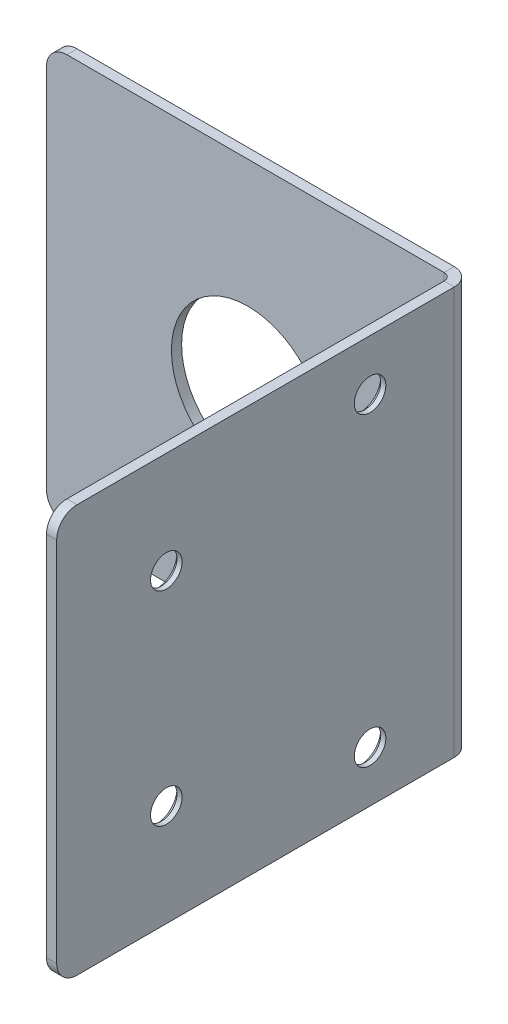
ISO-10303-21;
HEADER;
FILE_DESCRIPTION(('STEP AP214'),'2;1');
FILE_NAME('part.step','',(''),(''),'','','');
FILE_SCHEMA(('AUTOMOTIVE_DESIGN { 1 0 10303 214 1 1 1 1 }'));
ENDSEC;
DATA;
#1=APPLICATION_CONTEXT('core data for automotive mechanical design processes');
#2=APPLICATION_PROTOCOL_DEFINITION('international standard','automotive_design',2000,#1);
#3=PRODUCT_CONTEXT('',#1,'mechanical');
#4=PRODUCT('Part','Part','',(#3));
#5=PRODUCT_RELATED_PRODUCT_CATEGORY('part','',(#4));
#6=PRODUCT_DEFINITION_FORMATION('','',#4);
#7=PRODUCT_DEFINITION_CONTEXT('part definition',#1,'design');
#8=PRODUCT_DEFINITION('design','',#6,#7);
#9=PRODUCT_DEFINITION_SHAPE('','',#8);
#10=(LENGTH_UNIT() NAMED_UNIT(*) SI_UNIT(.MILLI.,.METRE.));
#11=(NAMED_UNIT(*) PLANE_ANGLE_UNIT() SI_UNIT($,.RADIAN.));
#12=(NAMED_UNIT(*) SI_UNIT($,.STERADIAN.) SOLID_ANGLE_UNIT());
#13=UNCERTAINTY_MEASURE_WITH_UNIT(LENGTH_MEASURE(1.E-05),#10,'distance_accuracy_value','');
#14=(GEOMETRIC_REPRESENTATION_CONTEXT(3) GLOBAL_UNCERTAINTY_ASSIGNED_CONTEXT((#13)) GLOBAL_UNIT_ASSIGNED_CONTEXT((#10,
#11,#12)) REPRESENTATION_CONTEXT('',''));
#15=CARTESIAN_POINT('',(0.,0.,0.));
#16=DIRECTION('',(0.,0.,1.));
#17=DIRECTION('',(1.,0.,0.));
#18=AXIS2_PLACEMENT_3D('',#15,#16,#17);
#19=CARTESIAN_POINT('',(-0.234623368857281,0.,-0.234623368857287));
#20=DIRECTION('',(1.,0.,0.));
#21=DIRECTION('',(0.,0.,-1.));
#22=AXIS2_PLACEMENT_3D('',#19,#20,#21);
#23=PLANE('',#22);
#24=CARTESIAN_POINT('',(-0.234623368857311,-15.,9.00000000000001));
#25=DIRECTION('',(1.,0.,0.));
#26=DIRECTION('',(0.,0.,-1.));
#27=AXIS2_PLACEMENT_3D('',#24,#25,#26);
#28=CIRCLE('',#27,2.05000000000001);
#29=CARTESIAN_POINT('',(-0.234623368857304,-15.,6.95));
#30=VERTEX_POINT('',#29);
#31=EDGE_CURVE('E248',#30,#30,#28,.T.);
#32=ORIENTED_EDGE('',*,*,#31,.T.);
#33=EDGE_LOOP('',(#32));
#34=FACE_BOUND('',#33,.T.);
#35=CARTESIAN_POINT('',(-0.234623368857381,-10.,29.));
#36=DIRECTION('',(1.,0.,0.));
#37=DIRECTION('',(0.,0.,-1.));
#38=AXIS2_PLACEMENT_3D('',#35,#36,#37);
#39=CIRCLE('',#38,2.05);
#40=CARTESIAN_POINT('',(-0.234623368857374,-10.,26.95));
#41=VERTEX_POINT('',#40);
#42=EDGE_CURVE('E245',#41,#41,#39,.T.);
#43=ORIENTED_EDGE('',*,*,#42,.T.);
#44=EDGE_LOOP('',(#43));
#45=FACE_BOUND('',#44,.T.);
#46=CARTESIAN_POINT('',(-0.234623368857384,10.,29.));
#47=DIRECTION('',(1.,0.,0.));
#48=DIRECTION('',(0.,0.,-1.));
#49=AXIS2_PLACEMENT_3D('',#46,#47,#48);
#50=CIRCLE('',#49,2.05000000000001);
#51=CARTESIAN_POINT('',(-0.234623368857377,10.,26.95));
#52=VERTEX_POINT('',#51);
#53=EDGE_CURVE('E242',#52,#52,#50,.T.);
#54=ORIENTED_EDGE('',*,*,#53,.T.);
#55=EDGE_LOOP('',(#54));
#56=FACE_BOUND('',#55,.T.);
#57=CARTESIAN_POINT('',(-0.234623368857315,15.,9.00000000000001));
#58=DIRECTION('',(1.,0.,0.));
#59=DIRECTION('',(0.,0.,-1.));
#60=AXIS2_PLACEMENT_3D('',#57,#58,#59);
#61=CIRCLE('',#60,2.05000000000003);
#62=CARTESIAN_POINT('',(-0.234623368857308,15.,6.94999999999998));
#63=VERTEX_POINT('',#62);
#64=EDGE_CURVE('E239',#63,#63,#61,.T.);
#65=ORIENTED_EDGE('',*,*,#64,.T.);
#66=EDGE_LOOP('',(#65));
#67=FACE_BOUND('',#66,.T.);
#68=DIRECTION('',(0.,0.,1.));
#69=VECTOR('',#68,1.);
#70=CARTESIAN_POINT('',(-0.234623368857138,-20.,-40.2346233688573));
#71=LINE('',#70,#69);
#72=CARTESIAN_POINT('',(-0.234623368857281,-20.,0.736600000000003));
#73=VERTEX_POINT('',#72);
#74=CARTESIAN_POINT('',(-0.23462336885741,-20.,37.7653766311427));
#75=VERTEX_POINT('',#74);
#76=EDGE_CURVE('E177',#73,#75,#71,.T.);
#77=ORIENTED_EDGE('',*,*,#76,.T.);
#78=CARTESIAN_POINT('',(-0.234623368857411,-18.,37.7653766311427));
#79=DIRECTION('',(1.,0.,0.));
#80=DIRECTION('',(0.,0.,-1.));
#81=AXIS2_PLACEMENT_3D('',#78,#79,#80);
#82=CIRCLE('',#81,2.);
#83=CARTESIAN_POINT('',(-0.234623368857418,-18.,39.7653766311427));
#84=VERTEX_POINT('',#83);
#85=EDGE_CURVE('E203',#75,#84,#82,.F.);
#86=ORIENTED_EDGE('',*,*,#85,.T.);
#87=DIRECTION('',(0.,1.,0.));
#88=VECTOR('',#87,1.);
#89=CARTESIAN_POINT('',(-0.234623368857417,-20.,39.7653766311427));
#90=LINE('',#89,#88);
#91=CARTESIAN_POINT('',(-0.234623368857423,18.,39.7653766311427));
#92=VERTEX_POINT('',#91);
#93=EDGE_CURVE('E178',#84,#92,#90,.T.);
#94=ORIENTED_EDGE('',*,*,#93,.T.);
#95=CARTESIAN_POINT('',(-0.234623368857416,18.,37.7653766311427));
#96=DIRECTION('',(1.,0.,0.));
#97=DIRECTION('',(0.,0.,-1.));
#98=AXIS2_PLACEMENT_3D('',#95,#96,#97);
#99=CIRCLE('',#98,2.);
#100=CARTESIAN_POINT('',(-0.234623368857417,20.,37.7653766311427));
#101=VERTEX_POINT('',#100);
#102=EDGE_CURVE('E201',#92,#101,#99,.F.);
#103=ORIENTED_EDGE('',*,*,#102,.T.);
#104=DIRECTION('',(0.,0.,-1.));
#105=VECTOR('',#104,1.);
#106=CARTESIAN_POINT('',(-0.234623368857144,20.,-40.2346233688573));
#107=LINE('',#106,#105);
#108=CARTESIAN_POINT('',(-0.234623368857287,20.,0.736600000000009));
#109=VERTEX_POINT('',#108);
#110=EDGE_CURVE('E181',#101,#109,#107,.T.);
#111=ORIENTED_EDGE('',*,*,#110,.T.);
#112=DIRECTION('',(0.,-1.,0.));
#113=VECTOR('',#112,1.);
#114=CARTESIAN_POINT('',(-0.234623368857284,0.,0.736600000000003));
#115=LINE('',#114,#113);
#116=EDGE_CURVE('E186',#109,#73,#115,.T.);
#117=ORIENTED_EDGE('',*,*,#116,.T.);
#118=EDGE_LOOP('',(#77,#86,#94,#103,#111,#117));
#119=FACE_BOUND('',#118,.T.);
#120=ADVANCED_FACE('F44',(#34,#45,#56,#67,#119),#23,.F.);
#121=CARTESIAN_POINT('',(0.765376631142583,-20.,39.7653766311427));
#122=DIRECTION('',(0.,0.,1.));
#123=DIRECTION('',(1.,0.,0.));
#124=AXIS2_PLACEMENT_3D('',#121,#122,#123);
#125=PLANE('',#124);
#126=ORIENTED_EDGE('',*,*,#93,.F.);
#127=DIRECTION('',(-1.,0.,0.));
#128=VECTOR('',#127,1.);
#129=CARTESIAN_POINT('',(0.765376631142582,-18.,39.7653766311427));
#130=LINE('',#129,#128);
#131=CARTESIAN_POINT('',(0.765376631142582,-18.,39.7653766311427));
#132=VERTEX_POINT('',#131);
#133=EDGE_CURVE('E208',#84,#132,#130,.F.);
#134=ORIENTED_EDGE('',*,*,#133,.T.);
#135=DIRECTION('',(0.,1.,0.));
#136=VECTOR('',#135,1.);
#137=CARTESIAN_POINT('',(0.765376631142583,-20.,39.7653766311427));
#138=LINE('',#137,#136);
#139=CARTESIAN_POINT('',(0.765376631142577,18.,39.7653766311427));
#140=VERTEX_POINT('',#139);
#141=EDGE_CURVE('E173',#132,#140,#138,.T.);
#142=ORIENTED_EDGE('',*,*,#141,.T.);
#143=DIRECTION('',(-1.,0.,0.));
#144=VECTOR('',#143,1.);
#145=CARTESIAN_POINT('',(0.765376631142577,18.,39.7653766311427));
#146=LINE('',#145,#144);
#147=EDGE_CURVE('E205',#140,#92,#146,.T.);
#148=ORIENTED_EDGE('',*,*,#147,.T.);
#149=EDGE_LOOP('',(#126,#134,#142,#148));
#150=FACE_BOUND('',#149,.T.);
#151=ADVANCED_FACE('F273',(#150),#125,.T.);
#152=CARTESIAN_POINT('',(0.765376631142862,-20.,-40.2346233688573));
#153=DIRECTION('',(0.,-1.,0.));
#154=DIRECTION('',(1.,0.,0.));
#155=AXIS2_PLACEMENT_3D('',#152,#153,#154);
#156=PLANE('',#155);
#157=DIRECTION('',(0.,0.,1.));
#158=VECTOR('',#157,1.);
#159=CARTESIAN_POINT('',(0.765376631142862,-20.,-40.2346233688573));
#160=LINE('',#159,#158);
#161=CARTESIAN_POINT('',(0.765376631142719,-20.,0.736600000000002));
#162=VERTEX_POINT('',#161);
#163=CARTESIAN_POINT('',(0.765376631142589,-20.,37.7653766311427));
#164=VERTEX_POINT('',#163);
#165=EDGE_CURVE('E184',#162,#164,#160,.T.);
#166=ORIENTED_EDGE('',*,*,#165,.T.);
#167=DIRECTION('',(-1.,0.,0.));
#168=VECTOR('',#167,1.);
#169=CARTESIAN_POINT('',(0.765376631142589,-20.,37.7653766311427));
#170=LINE('',#169,#168);
#171=EDGE_CURVE('E192',#164,#75,#170,.T.);
#172=ORIENTED_EDGE('',*,*,#171,.T.);
#173=ORIENTED_EDGE('',*,*,#76,.F.);
#174=DIRECTION('',(-1.,0.,0.));
#175=VECTOR('',#174,1.);
#176=CARTESIAN_POINT('',(0.765376631142719,-20.,0.736600000000006));
#177=LINE('',#176,#175);
#178=EDGE_CURVE('E183',#162,#73,#177,.T.);
#179=ORIENTED_EDGE('',*,*,#178,.F.);
#180=EDGE_LOOP('',(#166,#172,#173,#179));
#181=FACE_BOUND('',#180,.T.);
#182=ADVANCED_FACE('F279',(#181),#156,.T.);
#183=CARTESIAN_POINT('',(0.765376631142856,20.,-40.2346233688573));
#184=DIRECTION('',(0.,1.,0.));
#185=DIRECTION('',(-1.,0.,0.));
#186=AXIS2_PLACEMENT_3D('',#183,#184,#185);
#187=PLANE('',#186);
#188=ORIENTED_EDGE('',*,*,#110,.F.);
#189=DIRECTION('',(-1.,0.,0.));
#190=VECTOR('',#189,1.);
#191=CARTESIAN_POINT('',(0.765376631142583,20.,37.7653766311427));
#192=LINE('',#191,#190);
#193=CARTESIAN_POINT('',(0.765376631142583,20.,37.7653766311427));
#194=VERTEX_POINT('',#193);
#195=EDGE_CURVE('E214',#101,#194,#192,.F.);
#196=ORIENTED_EDGE('',*,*,#195,.T.);
#197=DIRECTION('',(0.,0.,-1.));
#198=VECTOR('',#197,1.);
#199=CARTESIAN_POINT('',(0.765376631142856,20.,-40.2346233688573));
#200=LINE('',#199,#198);
#201=CARTESIAN_POINT('',(0.765376631142713,20.,0.736600000000012));
#202=VERTEX_POINT('',#201);
#203=EDGE_CURVE('E176',#194,#202,#200,.T.);
#204=ORIENTED_EDGE('',*,*,#203,.T.);
#205=DIRECTION('',(1.,0.,0.));
#206=VECTOR('',#205,1.);
#207=CARTESIAN_POINT('',(0.765376631142713,20.,0.736600000000005));
#208=LINE('',#207,#206);
#209=EDGE_CURVE('E189',#109,#202,#208,.T.);
#210=ORIENTED_EDGE('',*,*,#209,.F.);
#211=EDGE_LOOP('',(#188,#196,#204,#210));
#212=FACE_BOUND('',#211,.T.);
#213=ADVANCED_FACE('F286',(#212),#187,.T.);
#214=CARTESIAN_POINT('',(0.765376631142719,0.,-0.234623368857283));
#215=DIRECTION('',(1.,0.,0.));
#216=DIRECTION('',(0.,0.,-1.));
#217=AXIS2_PLACEMENT_3D('',#214,#215,#216);
#218=PLANE('',#217);
#219=CARTESIAN_POINT('',(0.765376631142785,10.,29.));
#220=DIRECTION('',(-1.,0.,0.));
#221=DIRECTION('',(0.,0.,1.));
#222=AXIS2_PLACEMENT_3D('',#219,#220,#221);
#223=CIRCLE('',#222,1.55);
#224=CARTESIAN_POINT('',(0.765376631142779,10.,30.55));
#225=VERTEX_POINT('',#224);
#226=EDGE_CURVE('E333',#225,#225,#223,.T.);
#227=ORIENTED_EDGE('',*,*,#226,.T.);
#228=EDGE_LOOP('',(#227));
#229=FACE_BOUND('',#228,.T.);
#230=CARTESIAN_POINT('',(0.765376631142766,-10.,29.));
#231=DIRECTION('',(-1.,0.,0.));
#232=DIRECTION('',(0.,0.,-1.));
#233=AXIS2_PLACEMENT_3D('',#230,#231,#232);
#234=CIRCLE('',#233,1.55);
#235=CARTESIAN_POINT('',(0.765376631142772,-10.,27.45));
#236=VERTEX_POINT('',#235);
#237=EDGE_CURVE('E330',#236,#236,#234,.T.);
#238=ORIENTED_EDGE('',*,*,#237,.T.);
#239=EDGE_LOOP('',(#238));
#240=FACE_BOUND('',#239,.T.);
#241=CARTESIAN_POINT('',(0.765376631142831,-15.,9.00000000000001));
#242=DIRECTION('',(-1.,0.,0.));
#243=DIRECTION('',(0.,0.,-1.));
#244=AXIS2_PLACEMENT_3D('',#241,#242,#243);
#245=CIRCLE('',#244,1.55);
#246=CARTESIAN_POINT('',(0.765376631142837,-15.,7.45000000000001));
#247=VERTEX_POINT('',#246);
#248=EDGE_CURVE('E328',#247,#247,#245,.T.);
#249=ORIENTED_EDGE('',*,*,#248,.T.);
#250=EDGE_LOOP('',(#249));
#251=FACE_BOUND('',#250,.T.);
#252=CARTESIAN_POINT('',(0.765376631142859,15.,9.00000000000001));
#253=DIRECTION('',(-1.,0.,0.));
#254=DIRECTION('',(0.,0.,1.));
#255=AXIS2_PLACEMENT_3D('',#252,#253,#254);
#256=CIRCLE('',#255,1.55);
#257=CARTESIAN_POINT('',(0.765376631142854,15.,10.55));
#258=VERTEX_POINT('',#257);
#259=EDGE_CURVE('E339',#258,#258,#256,.T.);
#260=ORIENTED_EDGE('',*,*,#259,.T.);
#261=EDGE_LOOP('',(#260));
#262=FACE_BOUND('',#261,.T.);
#263=ORIENTED_EDGE('',*,*,#141,.F.);
#264=CARTESIAN_POINT('',(0.765376631142589,-18.,37.7653766311427));
#265=DIRECTION('',(1.,0.,0.));
#266=DIRECTION('',(0.,0.,-1.));
#267=AXIS2_PLACEMENT_3D('',#264,#265,#266);
#268=CIRCLE('',#267,2.);
#269=EDGE_CURVE('E212',#132,#164,#268,.T.);
#270=ORIENTED_EDGE('',*,*,#269,.T.);
#271=ORIENTED_EDGE('',*,*,#165,.F.);
#272=DIRECTION('',(0.,-1.,0.));
#273=VECTOR('',#272,1.);
#274=CARTESIAN_POINT('',(0.765376631142716,0.,0.736600000000007));
#275=LINE('',#274,#273);
#276=EDGE_CURVE('E160',#202,#162,#275,.T.);
#277=ORIENTED_EDGE('',*,*,#276,.F.);
#278=ORIENTED_EDGE('',*,*,#203,.F.);
#279=CARTESIAN_POINT('',(0.765376631142584,18.,37.7653766311427));
#280=DIRECTION('',(1.,0.,0.));
#281=DIRECTION('',(0.,0.,-1.));
#282=AXIS2_PLACEMENT_3D('',#279,#280,#281);
#283=CIRCLE('',#282,2.);
#284=EDGE_CURVE('E210',#194,#140,#283,.T.);
#285=ORIENTED_EDGE('',*,*,#284,.T.);
#286=EDGE_LOOP('',(#263,#270,#271,#277,#278,#285));
#287=FACE_BOUND('',#286,.T.);
#288=ADVANCED_FACE('F289',(#229,#240,#251,#262,#287),#218,.T.);
#289=CARTESIAN_POINT('',(-40.,-20.,-1.));
#290=DIRECTION('',(-1.,0.,0.));
#291=DIRECTION('',(0.,0.,1.));
#292=AXIS2_PLACEMENT_3D('',#289,#290,#291);
#293=PLANE('',#292);
#294=DIRECTION('',(0.,-1.,0.));
#295=VECTOR('',#294,1.);
#296=CARTESIAN_POINT('',(-40.,-20.,-1.));
#297=LINE('',#296,#295);
#298=CARTESIAN_POINT('',(-40.,18.,-1.));
#299=VERTEX_POINT('',#298);
#300=CARTESIAN_POINT('',(-40.,-18.,-1.));
#301=VERTEX_POINT('',#300);
#302=EDGE_CURVE('E167',#299,#301,#297,.T.);
#303=ORIENTED_EDGE('',*,*,#302,.T.);
#304=DIRECTION('',(0.,0.,1.));
#305=VECTOR('',#304,1.);
#306=CARTESIAN_POINT('',(-40.,-18.,-1.));
#307=LINE('',#306,#305);
#308=CARTESIAN_POINT('',(-40.,-18.,0.));
#309=VERTEX_POINT('',#308);
#310=EDGE_CURVE('E218',#301,#309,#307,.T.);
#311=ORIENTED_EDGE('',*,*,#310,.T.);
#312=DIRECTION('',(0.,-1.,0.));
#313=VECTOR('',#312,1.);
#314=CARTESIAN_POINT('',(-40.,-20.,0.));
#315=LINE('',#314,#313);
#316=CARTESIAN_POINT('',(-40.,18.,0.));
#317=VERTEX_POINT('',#316);
#318=EDGE_CURVE('E352',#317,#309,#315,.T.);
#319=ORIENTED_EDGE('',*,*,#318,.F.);
#320=DIRECTION('',(0.,0.,1.));
#321=VECTOR('',#320,1.);
#322=CARTESIAN_POINT('',(-40.,18.,-1.));
#323=LINE('',#322,#321);
#324=EDGE_CURVE('E216',#317,#299,#323,.F.);
#325=ORIENTED_EDGE('',*,*,#324,.T.);
#326=EDGE_LOOP('',(#303,#311,#319,#325));
#327=FACE_BOUND('',#326,.T.);
#328=ADVANCED_FACE('F366',(#327),#293,.T.);
#329=CARTESIAN_POINT('',(0.,0.,-1.));
#330=DIRECTION('',(0.,0.,-1.));
#331=DIRECTION('',(-1.,0.,0.));
#332=AXIS2_PLACEMENT_3D('',#329,#330,#331);
#333=PLANE('',#332);
#334=CARTESIAN_POINT('',(-20.2346233688573,0.,-1.));
#335=DIRECTION('',(0.,0.,-1.));
#336=DIRECTION('',(-1.,0.,0.));
#337=AXIS2_PLACEMENT_3D('',#334,#335,#336);
#338=CIRCLE('',#337,7.5);
#339=CARTESIAN_POINT('',(-27.7346233688573,0.,-1.));
#340=VERTEX_POINT('',#339);
#341=EDGE_CURVE('E236',#340,#340,#338,.T.);
#342=ORIENTED_EDGE('',*,*,#341,.F.);
#343=EDGE_LOOP('',(#342));
#344=FACE_BOUND('',#343,.T.);
#345=DIRECTION('',(1.,0.,0.));
#346=VECTOR('',#345,1.);
#347=CARTESIAN_POINT('',(-40.,-20.,-1.));
#348=LINE('',#347,#346);
#349=CARTESIAN_POINT('',(-38.,-20.,-1.));
#350=VERTEX_POINT('',#349);
#351=CARTESIAN_POINT('',(-0.971223368857278,-20.,-1.));
#352=VERTEX_POINT('',#351);
#353=EDGE_CURVE('E134',#350,#352,#348,.T.);
#354=ORIENTED_EDGE('',*,*,#353,.F.);
#355=CARTESIAN_POINT('',(-38.,-18.,-1.));
#356=DIRECTION('',(0.,0.,-1.));
#357=DIRECTION('',(-1.,0.,0.));
#358=AXIS2_PLACEMENT_3D('',#355,#356,#357);
#359=CIRCLE('',#358,2.);
#360=EDGE_CURVE('E227',#350,#301,#359,.T.);
#361=ORIENTED_EDGE('',*,*,#360,.T.);
#362=ORIENTED_EDGE('',*,*,#302,.F.);
#363=CARTESIAN_POINT('',(-38.,18.,-1.));
#364=DIRECTION('',(0.,0.,-1.));
#365=DIRECTION('',(-1.,0.,0.));
#366=AXIS2_PLACEMENT_3D('',#363,#364,#365);
#367=CIRCLE('',#366,2.);
#368=CARTESIAN_POINT('',(-38.,20.,-1.));
#369=VERTEX_POINT('',#368);
#370=EDGE_CURVE('E59',#299,#369,#367,.T.);
#371=ORIENTED_EDGE('',*,*,#370,.T.);
#372=DIRECTION('',(-1.,0.,0.));
#373=VECTOR('',#372,1.);
#374=CARTESIAN_POINT('',(-40.,20.,-1.));
#375=LINE('',#374,#373);
#376=CARTESIAN_POINT('',(-0.971223368857286,20.,-1.));
#377=VERTEX_POINT('',#376);
#378=EDGE_CURVE('E165',#377,#369,#375,.T.);
#379=ORIENTED_EDGE('',*,*,#378,.F.);
#380=DIRECTION('',(0.,-1.,0.));
#381=VECTOR('',#380,1.);
#382=CARTESIAN_POINT('',(-0.971223368857284,0.,-1.));
#383=LINE('',#382,#381);
#384=EDGE_CURVE('E140',#377,#352,#383,.T.);
#385=ORIENTED_EDGE('',*,*,#384,.T.);
#386=EDGE_LOOP('',(#354,#361,#362,#371,#379,#385));
#387=FACE_BOUND('',#386,.T.);
#388=ADVANCED_FACE('F164',(#344,#387),#333,.T.);
#389=CARTESIAN_POINT('',(-40.,-20.,-1.));
#390=DIRECTION('',(0.,-1.,0.));
#391=DIRECTION('',(0.,0.,-1.));
#392=AXIS2_PLACEMENT_3D('',#389,#390,#391);
#393=PLANE('',#392);
#394=DIRECTION('',(1.,0.,0.));
#395=VECTOR('',#394,1.);
#396=CARTESIAN_POINT('',(-40.,-20.,0.));
#397=LINE('',#396,#395);
#398=CARTESIAN_POINT('',(-38.,-20.,0.));
#399=VERTEX_POINT('',#398);
#400=CARTESIAN_POINT('',(-0.971223368857285,-20.,0.));
#401=VERTEX_POINT('',#400);
#402=EDGE_CURVE('E350',#399,#401,#397,.T.);
#403=ORIENTED_EDGE('',*,*,#402,.F.);
#404=DIRECTION('',(0.,0.,1.));
#405=VECTOR('',#404,1.);
#406=CARTESIAN_POINT('',(-38.,-20.,-1.));
#407=LINE('',#406,#405);
#408=EDGE_CURVE('E67',#399,#350,#407,.F.);
#409=ORIENTED_EDGE('',*,*,#408,.T.);
#410=ORIENTED_EDGE('',*,*,#353,.T.);
#411=DIRECTION('',(0.,0.,1.));
#412=VECTOR('',#411,1.);
#413=CARTESIAN_POINT('',(-0.971223368857278,-20.,-1.));
#414=LINE('',#413,#412);
#415=EDGE_CURVE('E137',#352,#401,#414,.T.);
#416=ORIENTED_EDGE('',*,*,#415,.T.);
#417=EDGE_LOOP('',(#403,#409,#410,#416));
#418=FACE_BOUND('',#417,.T.);
#419=ADVANCED_FACE('F136',(#418),#393,.T.);
#420=CARTESIAN_POINT('',(0.,0.,0.));
#421=DIRECTION('',(0.,0.,-1.));
#422=DIRECTION('',(-1.,0.,0.));
#423=AXIS2_PLACEMENT_3D('',#420,#421,#422);
#424=PLANE('',#423);
#425=CARTESIAN_POINT('',(-20.2346233688573,0.,0.));
#426=DIRECTION('',(0.,0.,-1.));
#427=DIRECTION('',(-1.,0.,0.));
#428=AXIS2_PLACEMENT_3D('',#425,#426,#427);
#429=CIRCLE('',#428,7.5);
#430=CARTESIAN_POINT('',(-27.7346233688573,0.,0.));
#431=VERTEX_POINT('',#430);
#432=EDGE_CURVE('E233',#431,#431,#429,.T.);
#433=ORIENTED_EDGE('',*,*,#432,.T.);
#434=EDGE_LOOP('',(#433));
#435=FACE_BOUND('',#434,.T.);
#436=ORIENTED_EDGE('',*,*,#318,.T.);
#437=CARTESIAN_POINT('',(-38.,-18.,0.));
#438=DIRECTION('',(0.,0.,-1.));
#439=DIRECTION('',(-1.,0.,0.));
#440=AXIS2_PLACEMENT_3D('',#437,#438,#439);
#441=CIRCLE('',#440,2.);
#442=EDGE_CURVE('E223',#309,#399,#441,.F.);
#443=ORIENTED_EDGE('',*,*,#442,.T.);
#444=ORIENTED_EDGE('',*,*,#402,.T.);
#445=DIRECTION('',(0.,-1.,0.));
#446=VECTOR('',#445,1.);
#447=CARTESIAN_POINT('',(-0.971223368857284,0.,0.));
#448=LINE('',#447,#446);
#449=CARTESIAN_POINT('',(-0.971223368857286,20.,0.));
#450=VERTEX_POINT('',#449);
#451=EDGE_CURVE('E161',#450,#401,#448,.T.);
#452=ORIENTED_EDGE('',*,*,#451,.F.);
#453=DIRECTION('',(-1.,0.,0.));
#454=VECTOR('',#453,1.);
#455=CARTESIAN_POINT('',(-40.,20.,0.));
#456=LINE('',#455,#454);
#457=CARTESIAN_POINT('',(-38.,20.,0.));
#458=VERTEX_POINT('',#457);
#459=EDGE_CURVE('E152',#450,#458,#456,.T.);
#460=ORIENTED_EDGE('',*,*,#459,.T.);
#461=CARTESIAN_POINT('',(-38.,18.,0.));
#462=DIRECTION('',(0.,0.,-1.));
#463=DIRECTION('',(-1.,0.,0.));
#464=AXIS2_PLACEMENT_3D('',#461,#462,#463);
#465=CIRCLE('',#464,2.);
#466=EDGE_CURVE('E221',#458,#317,#465,.F.);
#467=ORIENTED_EDGE('',*,*,#466,.T.);
#468=EDGE_LOOP('',(#436,#443,#444,#452,#460,#467));
#469=FACE_BOUND('',#468,.T.);
#470=ADVANCED_FACE('F359',(#435,#469),#424,.F.);
#471=CARTESIAN_POINT('',(-40.,20.,-1.));
#472=DIRECTION('',(0.,1.,0.));
#473=DIRECTION('',(0.,0.,1.));
#474=AXIS2_PLACEMENT_3D('',#471,#472,#473);
#475=PLANE('',#474);
#476=ORIENTED_EDGE('',*,*,#378,.T.);
#477=DIRECTION('',(0.,0.,1.));
#478=VECTOR('',#477,1.);
#479=CARTESIAN_POINT('',(-38.,20.,-1.));
#480=LINE('',#479,#478);
#481=EDGE_CURVE('E229',#369,#458,#480,.T.);
#482=ORIENTED_EDGE('',*,*,#481,.T.);
#483=ORIENTED_EDGE('',*,*,#459,.F.);
#484=DIRECTION('',(0.,0.,-1.));
#485=VECTOR('',#484,1.);
#486=CARTESIAN_POINT('',(-0.971223368857285,20.,-1.));
#487=LINE('',#486,#485);
#488=EDGE_CURVE('E348',#450,#377,#487,.T.);
#489=ORIENTED_EDGE('',*,*,#488,.T.);
#490=EDGE_LOOP('',(#476,#482,#483,#489));
#491=FACE_BOUND('',#490,.T.);
#492=ADVANCED_FACE('F362',(#491),#475,.T.);
#493=CARTESIAN_POINT('',(-0.971223368857287,20.,0.7366));
#494=DIRECTION('',(0.,1.,0.));
#495=DIRECTION('',(0.,0.,1.));
#496=AXIS2_PLACEMENT_3D('',#493,#494,#495);
#497=PLANE('',#496);
#498=ORIENTED_EDGE('',*,*,#488,.F.);
#499=CARTESIAN_POINT('',(-0.971223368857287,20.,0.7366));
#500=DIRECTION('',(0.,-1.,0.));
#501=DIRECTION('',(1.,0.,0.));
#502=AXIS2_PLACEMENT_3D('',#499,#500,#501);
#503=CIRCLE('',#502,0.7366);
#504=EDGE_CURVE('E342',#450,#109,#503,.T.);
#505=ORIENTED_EDGE('',*,*,#504,.T.);
#506=ORIENTED_EDGE('',*,*,#209,.T.);
#507=CARTESIAN_POINT('',(-0.971223368857287,20.,0.7366));
#508=DIRECTION('',(0.,-1.,0.));
#509=DIRECTION('',(0.,0.,1.));
#510=AXIS2_PLACEMENT_3D('',#507,#508,#509);
#511=CIRCLE('',#510,1.7366);
#512=EDGE_CURVE('E162',#377,#202,#511,.T.);
#513=ORIENTED_EDGE('',*,*,#512,.F.);
#514=EDGE_LOOP('',(#498,#505,#506,#513));
#515=FACE_BOUND('',#514,.T.);
#516=ADVANCED_FACE('F386',(#515),#497,.T.);
#517=CARTESIAN_POINT('',(-0.971223368857281,-20.,0.7366));
#518=DIRECTION('',(0.,-1.,0.));
#519=DIRECTION('',(0.,0.,-1.));
#520=AXIS2_PLACEMENT_3D('',#517,#518,#519);
#521=PLANE('',#520);
#522=CARTESIAN_POINT('',(-0.971223368857281,-20.,0.7366));
#523=DIRECTION('',(0.,-1.,0.));
#524=DIRECTION('',(1.,0.,0.));
#525=AXIS2_PLACEMENT_3D('',#522,#523,#524);
#526=CIRCLE('',#525,0.7366);
#527=EDGE_CURVE('E150',#73,#401,#526,.F.);
#528=ORIENTED_EDGE('',*,*,#527,.T.);
#529=ORIENTED_EDGE('',*,*,#415,.F.);
#530=CARTESIAN_POINT('',(-0.971223368857281,-20.,0.7366));
#531=DIRECTION('',(0.,1.,0.));
#532=DIRECTION('',(0.,0.,-1.));
#533=AXIS2_PLACEMENT_3D('',#530,#531,#532);
#534=CIRCLE('',#533,1.7366);
#535=EDGE_CURVE('E148',#162,#352,#534,.T.);
#536=ORIENTED_EDGE('',*,*,#535,.F.);
#537=ORIENTED_EDGE('',*,*,#178,.T.);
#538=EDGE_LOOP('',(#528,#529,#536,#537));
#539=FACE_BOUND('',#538,.T.);
#540=ADVANCED_FACE('F146',(#539),#521,.T.);
#541=CARTESIAN_POINT('',(-0.97122336885729,40.0596193108329,0.7366));
#542=DIRECTION('',(0.,-1.,0.));
#543=DIRECTION('',(1.,0.,0.));
#544=AXIS2_PLACEMENT_3D('',#541,#542,#543);
#545=CYLINDRICAL_SURFACE('',#544,1.7366);
#546=ORIENTED_EDGE('',*,*,#276,.T.);
#547=ORIENTED_EDGE('',*,*,#535,.T.);
#548=ORIENTED_EDGE('',*,*,#384,.F.);
#549=ORIENTED_EDGE('',*,*,#512,.T.);
#550=EDGE_LOOP('',(#546,#547,#548,#549));
#551=FACE_BOUND('',#550,.T.);
#552=ADVANCED_FACE('F156',(#551),#545,.T.);
#553=CARTESIAN_POINT('',(-0.97122336885729,40.0596193108329,0.7366));
#554=DIRECTION('',(0.,-1.,0.));
#555=DIRECTION('',(1.,0.,0.));
#556=AXIS2_PLACEMENT_3D('',#553,#554,#555);
#557=CYLINDRICAL_SURFACE('',#556,0.7366);
#558=ORIENTED_EDGE('',*,*,#116,.F.);
#559=ORIENTED_EDGE('',*,*,#504,.F.);
#560=ORIENTED_EDGE('',*,*,#451,.T.);
#561=ORIENTED_EDGE('',*,*,#527,.F.);
#562=EDGE_LOOP('',(#558,#559,#560,#561));
#563=FACE_BOUND('',#562,.T.);
#564=ADVANCED_FACE('F295',(#563),#557,.F.);
#565=CARTESIAN_POINT('',(0.765376631142589,-18.,37.7653766311427));
#566=DIRECTION('',(-1.,0.,0.));
#567=DIRECTION('',(0.,0.,1.));
#568=AXIS2_PLACEMENT_3D('',#565,#566,#567);
#569=CYLINDRICAL_SURFACE('',#568,2.);
#570=ORIENTED_EDGE('',*,*,#269,.F.);
#571=ORIENTED_EDGE('',*,*,#133,.F.);
#572=ORIENTED_EDGE('',*,*,#85,.F.);
#573=ORIENTED_EDGE('',*,*,#171,.F.);
#574=EDGE_LOOP('',(#570,#571,#572,#573));
#575=FACE_BOUND('',#574,.T.);
#576=ADVANCED_FACE('F291',(#575),#569,.T.);
#577=CARTESIAN_POINT('',(0.765376631142584,18.,37.7653766311427));
#578=DIRECTION('',(-1.,0.,0.));
#579=DIRECTION('',(0.,0.,1.));
#580=AXIS2_PLACEMENT_3D('',#577,#578,#579);
#581=CYLINDRICAL_SURFACE('',#580,2.);
#582=ORIENTED_EDGE('',*,*,#284,.F.);
#583=ORIENTED_EDGE('',*,*,#195,.F.);
#584=ORIENTED_EDGE('',*,*,#102,.F.);
#585=ORIENTED_EDGE('',*,*,#147,.F.);
#586=EDGE_LOOP('',(#582,#583,#584,#585));
#587=FACE_BOUND('',#586,.T.);
#588=ADVANCED_FACE('F294',(#587),#581,.T.);
#589=CARTESIAN_POINT('',(-38.,-18.,-1.));
#590=DIRECTION('',(0.,0.,1.));
#591=DIRECTION('',(1.,0.,0.));
#592=AXIS2_PLACEMENT_3D('',#589,#590,#591);
#593=CYLINDRICAL_SURFACE('',#592,2.);
#594=ORIENTED_EDGE('',*,*,#360,.F.);
#595=ORIENTED_EDGE('',*,*,#408,.F.);
#596=ORIENTED_EDGE('',*,*,#442,.F.);
#597=ORIENTED_EDGE('',*,*,#310,.F.);
#598=EDGE_LOOP('',(#594,#595,#596,#597));
#599=FACE_BOUND('',#598,.T.);
#600=ADVANCED_FACE('F299',(#599),#593,.T.);
#601=CARTESIAN_POINT('',(-38.,18.,-1.));
#602=DIRECTION('',(0.,0.,1.));
#603=DIRECTION('',(1.,0.,0.));
#604=AXIS2_PLACEMENT_3D('',#601,#602,#603);
#605=CYLINDRICAL_SURFACE('',#604,2.);
#606=ORIENTED_EDGE('',*,*,#370,.F.);
#607=ORIENTED_EDGE('',*,*,#324,.F.);
#608=ORIENTED_EDGE('',*,*,#466,.F.);
#609=ORIENTED_EDGE('',*,*,#481,.F.);
#610=EDGE_LOOP('',(#606,#607,#608,#609));
#611=FACE_BOUND('',#610,.T.);
#612=ADVANCED_FACE('F303',(#611),#605,.T.);
#613=CARTESIAN_POINT('',(0.765376631142859,15.,9.00000000000001));
#614=DIRECTION('',(-1.,0.,0.));
#615=DIRECTION('',(0.,0.,1.));
#616=AXIS2_PLACEMENT_3D('',#613,#614,#615);
#617=CYLINDRICAL_SURFACE('',#616,1.55);
#618=CARTESIAN_POINT('',(0.265376631142703,15.,9.00000000000001));
#619=DIRECTION('',(1.,0.,0.));
#620=DIRECTION('',(0.,0.,-1.));
#621=AXIS2_PLACEMENT_3D('',#618,#619,#620);
#622=CIRCLE('',#621,1.55);
#623=CARTESIAN_POINT('',(0.265376631142708,15.,7.45000000000001));
#624=VERTEX_POINT('',#623);
#625=EDGE_CURVE('E12',#624,#624,#622,.F.);
#626=ORIENTED_EDGE('',*,*,#625,.T.);
#627=EDGE_LOOP('',(#626));
#628=FACE_BOUND('',#627,.T.);
#629=ORIENTED_EDGE('',*,*,#259,.F.);
#630=EDGE_LOOP('',(#629));
#631=FACE_BOUND('',#630,.T.);
#632=ADVANCED_FACE('F307',(#628,#631),#617,.F.);
#633=CARTESIAN_POINT('',(0.765376631142831,-15.,9.00000000000001));
#634=DIRECTION('',(-1.,0.,0.));
#635=DIRECTION('',(0.,0.,1.));
#636=AXIS2_PLACEMENT_3D('',#633,#634,#635);
#637=CYLINDRICAL_SURFACE('',#636,1.55);
#638=CARTESIAN_POINT('',(0.265376631142695,-15.,9.00000000000001));
#639=DIRECTION('',(1.,0.,0.));
#640=DIRECTION('',(0.,0.,-1.));
#641=AXIS2_PLACEMENT_3D('',#638,#639,#640);
#642=CIRCLE('',#641,1.55);
#643=CARTESIAN_POINT('',(0.2653766311427,-15.,7.45000000000001));
#644=VERTEX_POINT('',#643);
#645=EDGE_CURVE('E232',#644,#644,#642,.F.);
#646=ORIENTED_EDGE('',*,*,#645,.T.);
#647=EDGE_LOOP('',(#646));
#648=FACE_BOUND('',#647,.T.);
#649=ORIENTED_EDGE('',*,*,#248,.F.);
#650=EDGE_LOOP('',(#649));
#651=FACE_BOUND('',#650,.T.);
#652=ADVANCED_FACE('F321',(#648,#651),#637,.F.);
#653=CARTESIAN_POINT('',(0.765376631142766,-10.,29.));
#654=DIRECTION('',(-1.,0.,0.));
#655=DIRECTION('',(0.,0.,1.));
#656=AXIS2_PLACEMENT_3D('',#653,#654,#655);
#657=CYLINDRICAL_SURFACE('',#656,1.55);
#658=CARTESIAN_POINT('',(0.265376631142623,-10.,29.));
#659=DIRECTION('',(1.,0.,0.));
#660=DIRECTION('',(0.,1.,0.));
#661=AXIS2_PLACEMENT_3D('',#658,#659,#660);
#662=CIRCLE('',#661,1.55);
#663=CARTESIAN_POINT('',(0.265376631142628,-8.45,29.));
#664=VERTEX_POINT('',#663);
#665=EDGE_CURVE('E251',#664,#664,#662,.F.);
#666=ORIENTED_EDGE('',*,*,#665,.T.);
#667=EDGE_LOOP('',(#666));
#668=FACE_BOUND('',#667,.T.);
#669=ORIENTED_EDGE('',*,*,#237,.F.);
#670=EDGE_LOOP('',(#669));
#671=FACE_BOUND('',#670,.T.);
#672=ADVANCED_FACE('F324',(#668,#671),#657,.F.);
#673=CARTESIAN_POINT('',(0.765376631142785,10.,29.));
#674=DIRECTION('',(-1.,0.,0.));
#675=DIRECTION('',(0.,0.,1.));
#676=AXIS2_PLACEMENT_3D('',#673,#674,#675);
#677=CYLINDRICAL_SURFACE('',#676,1.55);
#678=CARTESIAN_POINT('',(0.265376631142612,10.,29.));
#679=DIRECTION('',(1.,0.,0.));
#680=DIRECTION('',(0.,1.,0.));
#681=AXIS2_PLACEMENT_3D('',#678,#679,#680);
#682=CIRCLE('',#681,1.55);
#683=CARTESIAN_POINT('',(0.265376631142618,11.55,29.));
#684=VERTEX_POINT('',#683);
#685=EDGE_CURVE('E52',#684,#684,#682,.F.);
#686=ORIENTED_EDGE('',*,*,#685,.T.);
#687=EDGE_LOOP('',(#686));
#688=FACE_BOUND('',#687,.T.);
#689=ORIENTED_EDGE('',*,*,#226,.F.);
#690=EDGE_LOOP('',(#689));
#691=FACE_BOUND('',#690,.T.);
#692=ADVANCED_FACE('F256',(#688,#691),#677,.F.);
#693=CARTESIAN_POINT('',(-20.2346233688573,0.,39.7653766311427));
#694=DIRECTION('',(0.,0.,-1.));
#695=DIRECTION('',(-1.,0.,0.));
#696=AXIS2_PLACEMENT_3D('',#693,#694,#695);
#697=CYLINDRICAL_SURFACE('',#696,7.5);
#698=ORIENTED_EDGE('',*,*,#341,.T.);
#699=EDGE_LOOP('',(#698));
#700=FACE_BOUND('',#699,.T.);
#701=ORIENTED_EDGE('',*,*,#432,.F.);
#702=EDGE_LOOP('',(#701));
#703=FACE_BOUND('',#702,.T.);
#704=ADVANCED_FACE('F310',(#700,#703),#697,.F.);
#705=CARTESIAN_POINT('',(0.265376631142695,-15.,9.00000000000001));
#706=DIRECTION('',(-1.,0.,0.));
#707=DIRECTION('',(0.,0.,1.));
#708=AXIS2_PLACEMENT_3D('',#705,#706,#707);
#709=CONICAL_SURFACE('',#708,1.55,0.78539816339745);
#710=ORIENTED_EDGE('',*,*,#31,.F.);
#711=EDGE_LOOP('',(#710));
#712=FACE_BOUND('',#711,.T.);
#713=ORIENTED_EDGE('',*,*,#645,.F.);
#714=EDGE_LOOP('',(#713));
#715=FACE_BOUND('',#714,.T.);
#716=ADVANCED_FACE('F268',(#712,#715),#709,.F.);
#717=CARTESIAN_POINT('',(0.265376631142621,-10.,29.));
#718=DIRECTION('',(-1.,0.,0.));
#719=DIRECTION('',(0.,-1.,0.));
#720=AXIS2_PLACEMENT_3D('',#717,#718,#719);
#721=CONICAL_SURFACE('',#720,1.55,0.785398163397448);
#722=ORIENTED_EDGE('',*,*,#42,.F.);
#723=EDGE_LOOP('',(#722));
#724=FACE_BOUND('',#723,.T.);
#725=ORIENTED_EDGE('',*,*,#665,.F.);
#726=EDGE_LOOP('',(#725));
#727=FACE_BOUND('',#726,.T.);
#728=ADVANCED_FACE('F261',(#724,#727),#721,.F.);
#729=CARTESIAN_POINT('',(0.265376631142614,10.,29.));
#730=DIRECTION('',(-1.,0.,0.));
#731=DIRECTION('',(0.,-1.,0.));
#732=AXIS2_PLACEMENT_3D('',#729,#730,#731);
#733=CONICAL_SURFACE('',#732,1.55,0.785398163397459);
#734=ORIENTED_EDGE('',*,*,#53,.F.);
#735=EDGE_LOOP('',(#734));
#736=FACE_BOUND('',#735,.T.);
#737=ORIENTED_EDGE('',*,*,#685,.F.);
#738=EDGE_LOOP('',(#737));
#739=FACE_BOUND('',#738,.T.);
#740=ADVANCED_FACE('F259',(#736,#739),#733,.F.);
#741=CARTESIAN_POINT('',(0.265376631142702,15.,9.00000000000001));
#742=DIRECTION('',(-1.,0.,0.));
#743=DIRECTION('',(0.,0.,1.));
#744=AXIS2_PLACEMENT_3D('',#741,#742,#743);
#745=CONICAL_SURFACE('',#744,1.55,0.785398163397457);
#746=ORIENTED_EDGE('',*,*,#64,.F.);
#747=EDGE_LOOP('',(#746));
#748=FACE_BOUND('',#747,.T.);
#749=ORIENTED_EDGE('',*,*,#625,.F.);
#750=EDGE_LOOP('',(#749));
#751=FACE_BOUND('',#750,.T.);
#752=ADVANCED_FACE('F46',(#748,#751),#745,.F.);
#753=CLOSED_SHELL('',(#120,#151,#182,#213,#288,#328,#388,#419,#470,#492,#516,#540,#552,#564,
#576,#588,#600,#612,#632,#652,#672,#692,#704,#716,#728,#740,#752));
#754=MANIFOLD_SOLID_BREP('B2',#753);
#755=ADVANCED_BREP_SHAPE_REPRESENTATION('',(#18,#754),#14);
#756=SHAPE_DEFINITION_REPRESENTATION(#9,#755);
ENDSEC;
END-ISO-10303-21;
